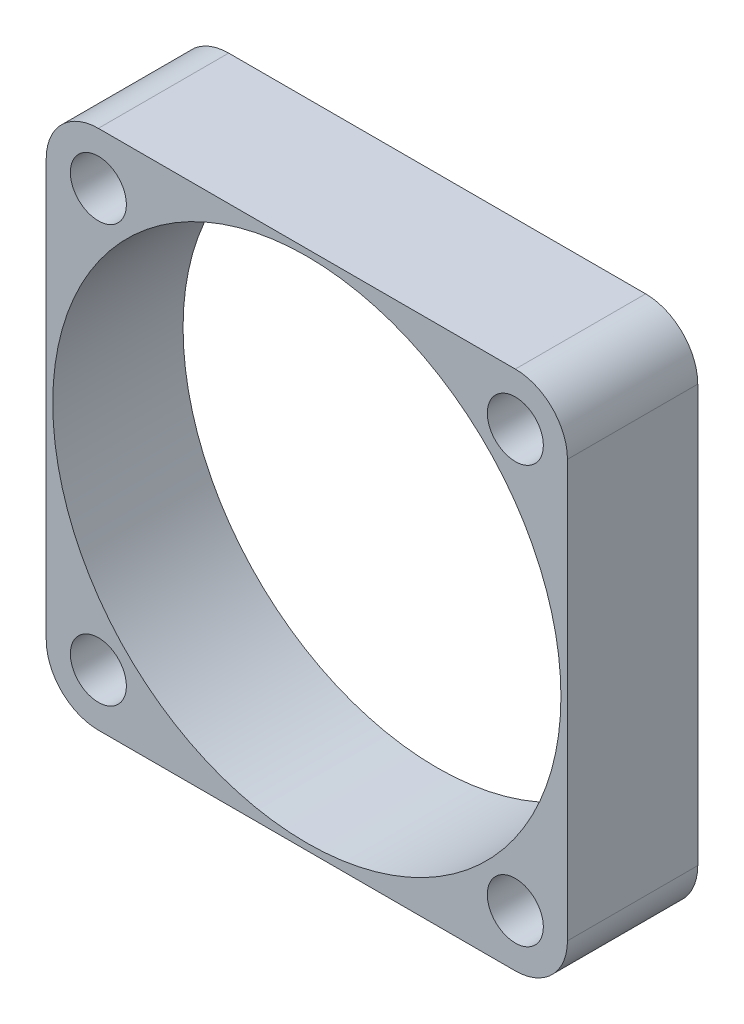
ISO-10303-21;
HEADER;
FILE_DESCRIPTION(('STEP AP214'),'2;1');
FILE_NAME('part.step','',(''),(''),'','','');
FILE_SCHEMA(('AUTOMOTIVE_DESIGN { 1 0 10303 214 1 1 1 1 }'));
ENDSEC;
DATA;
#1=APPLICATION_CONTEXT('core data for automotive mechanical design processes');
#2=APPLICATION_PROTOCOL_DEFINITION('international standard','automotive_design',2000,#1);
#3=PRODUCT_CONTEXT('',#1,'mechanical');
#4=PRODUCT('Part','Part','',(#3));
#5=PRODUCT_RELATED_PRODUCT_CATEGORY('part','',(#4));
#6=PRODUCT_DEFINITION_FORMATION('','',#4);
#7=PRODUCT_DEFINITION_CONTEXT('part definition',#1,'design');
#8=PRODUCT_DEFINITION('design','',#6,#7);
#9=PRODUCT_DEFINITION_SHAPE('','',#8);
#10=(LENGTH_UNIT() NAMED_UNIT(*) SI_UNIT(.MILLI.,.METRE.));
#11=(NAMED_UNIT(*) PLANE_ANGLE_UNIT() SI_UNIT($,.RADIAN.));
#12=(NAMED_UNIT(*) SI_UNIT($,.STERADIAN.) SOLID_ANGLE_UNIT());
#13=UNCERTAINTY_MEASURE_WITH_UNIT(LENGTH_MEASURE(1.E-05),#10,'distance_accuracy_value','');
#14=(GEOMETRIC_REPRESENTATION_CONTEXT(3) GLOBAL_UNCERTAINTY_ASSIGNED_CONTEXT((#13)) GLOBAL_UNIT_ASSIGNED_CONTEXT((#10,
#11,#12)) REPRESENTATION_CONTEXT('',''));
#15=CARTESIAN_POINT('',(0.,0.,0.));
#16=DIRECTION('',(0.,0.,1.));
#17=DIRECTION('',(1.,0.,0.));
#18=AXIS2_PLACEMENT_3D('',#15,#16,#17);
#19=CARTESIAN_POINT('',(36.,-4.,10.));
#20=DIRECTION('',(0.,0.,-1.));
#21=DIRECTION('',(-1.,0.,0.));
#22=AXIS2_PLACEMENT_3D('',#19,#20,#21);
#23=CYLINDRICAL_SURFACE('',#22,3.99999999999999);
#24=CARTESIAN_POINT('',(36.,-4.,0.));
#25=DIRECTION('',(0.,0.,1.));
#26=DIRECTION('',(-1.,0.,0.));
#27=AXIS2_PLACEMENT_3D('',#24,#25,#26);
#28=CIRCLE('',#27,3.99999999999999);
#29=CARTESIAN_POINT('',(40.,-4.,0.));
#30=VERTEX_POINT('',#29);
#31=CARTESIAN_POINT('',(36.,0.,0.));
#32=VERTEX_POINT('',#31);
#33=EDGE_CURVE('E99',#30,#32,#28,.T.);
#34=ORIENTED_EDGE('',*,*,#33,.T.);
#35=DIRECTION('',(0.,0.,-1.));
#36=VECTOR('',#35,1.);
#37=CARTESIAN_POINT('',(36.,0.,10.));
#38=LINE('',#37,#36);
#39=CARTESIAN_POINT('',(36.,0.,10.));
#40=VERTEX_POINT('',#39);
#41=EDGE_CURVE('E11',#40,#32,#38,.T.);
#42=ORIENTED_EDGE('',*,*,#41,.F.);
#43=CARTESIAN_POINT('',(36.,-4.,10.));
#44=DIRECTION('',(0.,0.,1.));
#45=DIRECTION('',(-1.,0.,0.));
#46=AXIS2_PLACEMENT_3D('',#43,#44,#45);
#47=CIRCLE('',#46,3.99999999999999);
#48=CARTESIAN_POINT('',(40.,-4.,10.));
#49=VERTEX_POINT('',#48);
#50=EDGE_CURVE('E132',#49,#40,#47,.T.);
#51=ORIENTED_EDGE('',*,*,#50,.F.);
#52=DIRECTION('',(0.,0.,-1.));
#53=VECTOR('',#52,1.);
#54=CARTESIAN_POINT('',(40.,-4.,10.));
#55=LINE('',#54,#53);
#56=EDGE_CURVE('E112',#49,#30,#55,.T.);
#57=ORIENTED_EDGE('',*,*,#56,.T.);
#58=EDGE_LOOP('',(#34,#42,#51,#57));
#59=FACE_BOUND('',#58,.T.);
#60=ADVANCED_FACE('F29',(#59),#23,.T.);
#61=CARTESIAN_POINT('',(4.00000000000003,0.,10.));
#62=DIRECTION('',(0.,-1.,0.));
#63=DIRECTION('',(0.,0.,-1.));
#64=AXIS2_PLACEMENT_3D('',#61,#62,#63);
#65=PLANE('',#64);
#66=DIRECTION('',(-1.,0.,0.));
#67=VECTOR('',#66,1.);
#68=CARTESIAN_POINT('',(4.00000000000003,0.,0.));
#69=LINE('',#68,#67);
#70=CARTESIAN_POINT('',(4.00000000000003,0.,0.));
#71=VERTEX_POINT('',#70);
#72=EDGE_CURVE('E95',#32,#71,#69,.T.);
#73=ORIENTED_EDGE('',*,*,#72,.T.);
#74=DIRECTION('',(0.,0.,-1.));
#75=VECTOR('',#74,1.);
#76=CARTESIAN_POINT('',(4.00000000000003,0.,10.));
#77=LINE('',#76,#75);
#78=CARTESIAN_POINT('',(4.00000000000003,0.,10.));
#79=VERTEX_POINT('',#78);
#80=EDGE_CURVE('E37',#79,#71,#77,.T.);
#81=ORIENTED_EDGE('',*,*,#80,.F.);
#82=DIRECTION('',(-1.,0.,0.));
#83=VECTOR('',#82,1.);
#84=CARTESIAN_POINT('',(4.00000000000003,0.,10.));
#85=LINE('',#84,#83);
#86=EDGE_CURVE('E108',#40,#79,#85,.T.);
#87=ORIENTED_EDGE('',*,*,#86,.F.);
#88=ORIENTED_EDGE('',*,*,#41,.T.);
#89=EDGE_LOOP('',(#73,#81,#87,#88));
#90=FACE_BOUND('',#89,.T.);
#91=ADVANCED_FACE('F107',(#90),#65,.F.);
#92=CARTESIAN_POINT('',(4.,-4.,10.));
#93=DIRECTION('',(0.,0.,-1.));
#94=DIRECTION('',(-1.,0.,0.));
#95=AXIS2_PLACEMENT_3D('',#92,#93,#94);
#96=CYLINDRICAL_SURFACE('',#95,4.);
#97=CARTESIAN_POINT('',(4.,-4.,0.));
#98=DIRECTION('',(0.,0.,1.));
#99=DIRECTION('',(-1.,0.,0.));
#100=AXIS2_PLACEMENT_3D('',#97,#98,#99);
#101=CIRCLE('',#100,4.);
#102=CARTESIAN_POINT('',(0.,-4.00000000000003,0.));
#103=VERTEX_POINT('',#102);
#104=EDGE_CURVE('E101',#71,#103,#101,.T.);
#105=ORIENTED_EDGE('',*,*,#104,.T.);
#106=DIRECTION('',(0.,0.,-1.));
#107=VECTOR('',#106,1.);
#108=CARTESIAN_POINT('',(0.,-4.00000000000003,10.));
#109=LINE('',#108,#107);
#110=CARTESIAN_POINT('',(0.,-4.00000000000003,10.));
#111=VERTEX_POINT('',#110);
#112=EDGE_CURVE('E158',#111,#103,#109,.T.);
#113=ORIENTED_EDGE('',*,*,#112,.F.);
#114=CARTESIAN_POINT('',(4.,-4.,10.));
#115=DIRECTION('',(0.,0.,1.));
#116=DIRECTION('',(-1.,0.,0.));
#117=AXIS2_PLACEMENT_3D('',#114,#115,#116);
#118=CIRCLE('',#117,4.);
#119=EDGE_CURVE('E135',#79,#111,#118,.T.);
#120=ORIENTED_EDGE('',*,*,#119,.F.);
#121=ORIENTED_EDGE('',*,*,#80,.T.);
#122=EDGE_LOOP('',(#105,#113,#120,#121));
#123=FACE_BOUND('',#122,.T.);
#124=ADVANCED_FACE('F199',(#123),#96,.T.);
#125=CARTESIAN_POINT('',(0.,-4.00000000000003,10.));
#126=DIRECTION('',(1.,0.,0.));
#127=DIRECTION('',(0.,1.,0.));
#128=AXIS2_PLACEMENT_3D('',#125,#126,#127);
#129=PLANE('',#128);
#130=DIRECTION('',(0.,-1.,0.));
#131=VECTOR('',#130,1.);
#132=CARTESIAN_POINT('',(0.,-4.00000000000003,0.));
#133=LINE('',#132,#131);
#134=CARTESIAN_POINT('',(0.,-36.,0.));
#135=VERTEX_POINT('',#134);
#136=EDGE_CURVE('E122',#103,#135,#133,.T.);
#137=ORIENTED_EDGE('',*,*,#136,.T.);
#138=DIRECTION('',(0.,0.,-1.));
#139=VECTOR('',#138,1.);
#140=CARTESIAN_POINT('',(0.,-36.,10.));
#141=LINE('',#140,#139);
#142=CARTESIAN_POINT('',(0.,-36.,10.));
#143=VERTEX_POINT('',#142);
#144=EDGE_CURVE('E155',#143,#135,#141,.T.);
#145=ORIENTED_EDGE('',*,*,#144,.F.);
#146=DIRECTION('',(0.,-1.,0.));
#147=VECTOR('',#146,1.);
#148=CARTESIAN_POINT('',(0.,-4.00000000000003,10.));
#149=LINE('',#148,#147);
#150=EDGE_CURVE('E137',#111,#143,#149,.T.);
#151=ORIENTED_EDGE('',*,*,#150,.F.);
#152=ORIENTED_EDGE('',*,*,#112,.T.);
#153=EDGE_LOOP('',(#137,#145,#151,#152));
#154=FACE_BOUND('',#153,.T.);
#155=ADVANCED_FACE('F203',(#154),#129,.F.);
#156=CARTESIAN_POINT('',(4.,-36.,10.));
#157=DIRECTION('',(0.,0.,-1.));
#158=DIRECTION('',(-1.,0.,0.));
#159=AXIS2_PLACEMENT_3D('',#156,#157,#158);
#160=CYLINDRICAL_SURFACE('',#159,4.);
#161=CARTESIAN_POINT('',(4.,-36.,0.));
#162=DIRECTION('',(0.,0.,1.));
#163=DIRECTION('',(-1.,0.,0.));
#164=AXIS2_PLACEMENT_3D('',#161,#162,#163);
#165=CIRCLE('',#164,4.);
#166=CARTESIAN_POINT('',(4.00000000000003,-40.,0.));
#167=VERTEX_POINT('',#166);
#168=EDGE_CURVE('E124',#135,#167,#165,.T.);
#169=ORIENTED_EDGE('',*,*,#168,.T.);
#170=DIRECTION('',(0.,0.,-1.));
#171=VECTOR('',#170,1.);
#172=CARTESIAN_POINT('',(4.00000000000003,-40.,10.));
#173=LINE('',#172,#171);
#174=CARTESIAN_POINT('',(4.00000000000003,-40.,10.));
#175=VERTEX_POINT('',#174);
#176=EDGE_CURVE('E152',#175,#167,#173,.T.);
#177=ORIENTED_EDGE('',*,*,#176,.F.);
#178=CARTESIAN_POINT('',(4.,-36.,10.));
#179=DIRECTION('',(0.,0.,1.));
#180=DIRECTION('',(-1.,0.,0.));
#181=AXIS2_PLACEMENT_3D('',#178,#179,#180);
#182=CIRCLE('',#181,4.);
#183=EDGE_CURVE('E139',#143,#175,#182,.T.);
#184=ORIENTED_EDGE('',*,*,#183,.F.);
#185=ORIENTED_EDGE('',*,*,#144,.T.);
#186=EDGE_LOOP('',(#169,#177,#184,#185));
#187=FACE_BOUND('',#186,.T.);
#188=ADVANCED_FACE('F209',(#187),#160,.T.);
#189=CARTESIAN_POINT('',(4.00000000000003,-40.,10.));
#190=DIRECTION('',(0.,1.,0.));
#191=DIRECTION('',(0.,0.,1.));
#192=AXIS2_PLACEMENT_3D('',#189,#190,#191);
#193=PLANE('',#192);
#194=DIRECTION('',(1.,0.,0.));
#195=VECTOR('',#194,1.);
#196=CARTESIAN_POINT('',(4.00000000000003,-40.,0.));
#197=LINE('',#196,#195);
#198=CARTESIAN_POINT('',(36.,-40.,0.));
#199=VERTEX_POINT('',#198);
#200=EDGE_CURVE('E126',#167,#199,#197,.T.);
#201=ORIENTED_EDGE('',*,*,#200,.T.);
#202=DIRECTION('',(0.,0.,-1.));
#203=VECTOR('',#202,1.);
#204=CARTESIAN_POINT('',(36.,-40.,10.));
#205=LINE('',#204,#203);
#206=CARTESIAN_POINT('',(36.,-40.,10.));
#207=VERTEX_POINT('',#206);
#208=EDGE_CURVE('E149',#207,#199,#205,.T.);
#209=ORIENTED_EDGE('',*,*,#208,.F.);
#210=DIRECTION('',(1.,0.,0.));
#211=VECTOR('',#210,1.);
#212=CARTESIAN_POINT('',(4.00000000000003,-40.,10.));
#213=LINE('',#212,#211);
#214=EDGE_CURVE('E141',#175,#207,#213,.T.);
#215=ORIENTED_EDGE('',*,*,#214,.F.);
#216=ORIENTED_EDGE('',*,*,#176,.T.);
#217=EDGE_LOOP('',(#201,#209,#215,#216));
#218=FACE_BOUND('',#217,.T.);
#219=ADVANCED_FACE('F213',(#218),#193,.F.);
#220=CARTESIAN_POINT('',(36.,-36.,10.));
#221=DIRECTION('',(0.,0.,-1.));
#222=DIRECTION('',(-1.,0.,0.));
#223=AXIS2_PLACEMENT_3D('',#220,#221,#222);
#224=CYLINDRICAL_SURFACE('',#223,4.);
#225=CARTESIAN_POINT('',(36.,-36.,0.));
#226=DIRECTION('',(0.,0.,1.));
#227=DIRECTION('',(1.,0.,0.));
#228=AXIS2_PLACEMENT_3D('',#225,#226,#227);
#229=CIRCLE('',#228,4.);
#230=CARTESIAN_POINT('',(40.,-36.,0.));
#231=VERTEX_POINT('',#230);
#232=EDGE_CURVE('E128',#199,#231,#229,.T.);
#233=ORIENTED_EDGE('',*,*,#232,.T.);
#234=DIRECTION('',(0.,0.,-1.));
#235=VECTOR('',#234,1.);
#236=CARTESIAN_POINT('',(40.,-36.,10.));
#237=LINE('',#236,#235);
#238=CARTESIAN_POINT('',(40.,-36.,10.));
#239=VERTEX_POINT('',#238);
#240=EDGE_CURVE('E146',#239,#231,#237,.T.);
#241=ORIENTED_EDGE('',*,*,#240,.F.);
#242=CARTESIAN_POINT('',(36.,-36.,10.));
#243=DIRECTION('',(0.,0.,1.));
#244=DIRECTION('',(1.,0.,0.));
#245=AXIS2_PLACEMENT_3D('',#242,#243,#244);
#246=CIRCLE('',#245,4.);
#247=EDGE_CURVE('E50',#207,#239,#246,.T.);
#248=ORIENTED_EDGE('',*,*,#247,.F.);
#249=ORIENTED_EDGE('',*,*,#208,.T.);
#250=EDGE_LOOP('',(#233,#241,#248,#249));
#251=FACE_BOUND('',#250,.T.);
#252=ADVANCED_FACE('F216',(#251),#224,.T.);
#253=CARTESIAN_POINT('',(40.,-4.,10.));
#254=DIRECTION('',(-1.,0.,0.));
#255=DIRECTION('',(0.,-1.,0.));
#256=AXIS2_PLACEMENT_3D('',#253,#254,#255);
#257=PLANE('',#256);
#258=DIRECTION('',(0.,1.,0.));
#259=VECTOR('',#258,1.);
#260=CARTESIAN_POINT('',(40.,-4.,0.));
#261=LINE('',#260,#259);
#262=EDGE_CURVE('E130',#231,#30,#261,.T.);
#263=ORIENTED_EDGE('',*,*,#262,.T.);
#264=ORIENTED_EDGE('',*,*,#56,.F.);
#265=DIRECTION('',(0.,1.,0.));
#266=VECTOR('',#265,1.);
#267=CARTESIAN_POINT('',(40.,-4.,10.));
#268=LINE('',#267,#266);
#269=EDGE_CURVE('E45',#239,#49,#268,.T.);
#270=ORIENTED_EDGE('',*,*,#269,.F.);
#271=ORIENTED_EDGE('',*,*,#240,.T.);
#272=EDGE_LOOP('',(#263,#264,#270,#271));
#273=FACE_BOUND('',#272,.T.);
#274=ADVANCED_FACE('F191',(#273),#257,.F.);
#275=CARTESIAN_POINT('',(36.,-4.,10.));
#276=DIRECTION('',(0.,0.,-1.));
#277=DIRECTION('',(-1.,0.,0.));
#278=AXIS2_PLACEMENT_3D('',#275,#276,#277);
#279=PLANE('',#278);
#280=CARTESIAN_POINT('',(36.,-36.,10.));
#281=DIRECTION('',(0.,0.,1.));
#282=DIRECTION('',(1.,0.,0.));
#283=AXIS2_PLACEMENT_3D('',#280,#281,#282);
#284=CIRCLE('',#283,2.15);
#285=CARTESIAN_POINT('',(38.15,-36.,10.));
#286=VERTEX_POINT('',#285);
#287=EDGE_CURVE('E181',#286,#286,#284,.T.);
#288=ORIENTED_EDGE('',*,*,#287,.F.);
#289=EDGE_LOOP('',(#288));
#290=FACE_BOUND('',#289,.T.);
#291=CARTESIAN_POINT('',(4.,-36.,10.));
#292=DIRECTION('',(0.,0.,1.));
#293=DIRECTION('',(1.,0.,0.));
#294=AXIS2_PLACEMENT_3D('',#291,#292,#293);
#295=CIRCLE('',#294,2.15);
#296=CARTESIAN_POINT('',(6.15,-36.,10.));
#297=VERTEX_POINT('',#296);
#298=EDGE_CURVE('E171',#297,#297,#295,.T.);
#299=ORIENTED_EDGE('',*,*,#298,.F.);
#300=EDGE_LOOP('',(#299));
#301=FACE_BOUND('',#300,.T.);
#302=CARTESIAN_POINT('',(4.,-4.,10.));
#303=DIRECTION('',(0.,0.,1.));
#304=DIRECTION('',(1.,0.,0.));
#305=AXIS2_PLACEMENT_3D('',#302,#303,#304);
#306=CIRCLE('',#305,2.15);
#307=CARTESIAN_POINT('',(6.15,-4.,10.));
#308=VERTEX_POINT('',#307);
#309=EDGE_CURVE('E168',#308,#308,#306,.T.);
#310=ORIENTED_EDGE('',*,*,#309,.F.);
#311=EDGE_LOOP('',(#310));
#312=FACE_BOUND('',#311,.T.);
#313=CARTESIAN_POINT('',(36.,-4.,10.));
#314=DIRECTION('',(0.,0.,1.));
#315=DIRECTION('',(1.,0.,0.));
#316=AXIS2_PLACEMENT_3D('',#313,#314,#315);
#317=CIRCLE('',#316,2.15);
#318=CARTESIAN_POINT('',(38.15,-4.,10.));
#319=VERTEX_POINT('',#318);
#320=EDGE_CURVE('E165',#319,#319,#317,.T.);
#321=ORIENTED_EDGE('',*,*,#320,.F.);
#322=EDGE_LOOP('',(#321));
#323=FACE_BOUND('',#322,.T.);
#324=CARTESIAN_POINT('',(20.,-20.,10.));
#325=DIRECTION('',(0.,0.,1.));
#326=DIRECTION('',(1.,0.,0.));
#327=AXIS2_PLACEMENT_3D('',#324,#325,#326);
#328=CIRCLE('',#327,19.5);
#329=CARTESIAN_POINT('',(39.5,-20.,10.));
#330=VERTEX_POINT('',#329);
#331=EDGE_CURVE('E116',#330,#330,#328,.T.);
#332=ORIENTED_EDGE('',*,*,#331,.F.);
#333=EDGE_LOOP('',(#332));
#334=FACE_BOUND('',#333,.T.);
#335=ORIENTED_EDGE('',*,*,#50,.T.);
#336=ORIENTED_EDGE('',*,*,#86,.T.);
#337=ORIENTED_EDGE('',*,*,#119,.T.);
#338=ORIENTED_EDGE('',*,*,#150,.T.);
#339=ORIENTED_EDGE('',*,*,#183,.T.);
#340=ORIENTED_EDGE('',*,*,#214,.T.);
#341=ORIENTED_EDGE('',*,*,#247,.T.);
#342=ORIENTED_EDGE('',*,*,#269,.T.);
#343=EDGE_LOOP('',(#335,#336,#337,#338,#339,#340,#341,#342));
#344=FACE_BOUND('',#343,.T.);
#345=ADVANCED_FACE('F188',(#290,#301,#312,#323,#334,#344),#279,.F.);
#346=CARTESIAN_POINT('',(36.,-4.,0.));
#347=DIRECTION('',(0.,0.,-1.));
#348=DIRECTION('',(-1.,0.,0.));
#349=AXIS2_PLACEMENT_3D('',#346,#347,#348);
#350=PLANE('',#349);
#351=CARTESIAN_POINT('',(36.,-36.,0.));
#352=DIRECTION('',(0.,0.,-1.));
#353=DIRECTION('',(-1.,0.,0.));
#354=AXIS2_PLACEMENT_3D('',#351,#352,#353);
#355=CIRCLE('',#354,2.15);
#356=CARTESIAN_POINT('',(33.85,-36.,0.));
#357=VERTEX_POINT('',#356);
#358=EDGE_CURVE('E32',#357,#357,#355,.T.);
#359=ORIENTED_EDGE('',*,*,#358,.F.);
#360=EDGE_LOOP('',(#359));
#361=FACE_BOUND('',#360,.T.);
#362=CARTESIAN_POINT('',(4.,-36.,0.));
#363=DIRECTION('',(0.,0.,-1.));
#364=DIRECTION('',(-1.,0.,0.));
#365=AXIS2_PLACEMENT_3D('',#362,#363,#364);
#366=CIRCLE('',#365,2.15);
#367=CARTESIAN_POINT('',(1.85,-36.,0.));
#368=VERTEX_POINT('',#367);
#369=EDGE_CURVE('E169',#368,#368,#366,.T.);
#370=ORIENTED_EDGE('',*,*,#369,.F.);
#371=EDGE_LOOP('',(#370));
#372=FACE_BOUND('',#371,.T.);
#373=CARTESIAN_POINT('',(4.,-4.,0.));
#374=DIRECTION('',(0.,0.,-1.));
#375=DIRECTION('',(-1.,0.,0.));
#376=AXIS2_PLACEMENT_3D('',#373,#374,#375);
#377=CIRCLE('',#376,2.15);
#378=CARTESIAN_POINT('',(1.85,-4.,0.));
#379=VERTEX_POINT('',#378);
#380=EDGE_CURVE('E166',#379,#379,#377,.T.);
#381=ORIENTED_EDGE('',*,*,#380,.F.);
#382=EDGE_LOOP('',(#381));
#383=FACE_BOUND('',#382,.T.);
#384=CARTESIAN_POINT('',(36.,-4.,0.));
#385=DIRECTION('',(0.,0.,-1.));
#386=DIRECTION('',(-1.,0.,0.));
#387=AXIS2_PLACEMENT_3D('',#384,#385,#386);
#388=CIRCLE('',#387,2.15);
#389=CARTESIAN_POINT('',(33.85,-4.,0.));
#390=VERTEX_POINT('',#389);
#391=EDGE_CURVE('E162',#390,#390,#388,.T.);
#392=ORIENTED_EDGE('',*,*,#391,.F.);
#393=EDGE_LOOP('',(#392));
#394=FACE_BOUND('',#393,.T.);
#395=CARTESIAN_POINT('',(20.,-20.,0.));
#396=DIRECTION('',(0.,0.,-1.));
#397=DIRECTION('',(-1.,0.,0.));
#398=AXIS2_PLACEMENT_3D('',#395,#396,#397);
#399=CIRCLE('',#398,19.5);
#400=CARTESIAN_POINT('',(0.500000000000007,-20.,0.));
#401=VERTEX_POINT('',#400);
#402=EDGE_CURVE('E113',#401,#401,#399,.T.);
#403=ORIENTED_EDGE('',*,*,#402,.F.);
#404=EDGE_LOOP('',(#403));
#405=FACE_BOUND('',#404,.T.);
#406=ORIENTED_EDGE('',*,*,#33,.F.);
#407=ORIENTED_EDGE('',*,*,#262,.F.);
#408=ORIENTED_EDGE('',*,*,#232,.F.);
#409=ORIENTED_EDGE('',*,*,#200,.F.);
#410=ORIENTED_EDGE('',*,*,#168,.F.);
#411=ORIENTED_EDGE('',*,*,#136,.F.);
#412=ORIENTED_EDGE('',*,*,#104,.F.);
#413=ORIENTED_EDGE('',*,*,#72,.F.);
#414=EDGE_LOOP('',(#406,#407,#408,#409,#410,#411,#412,#413));
#415=FACE_BOUND('',#414,.T.);
#416=ADVANCED_FACE('F96',(#361,#372,#383,#394,#405,#415),#350,.T.);
#417=CARTESIAN_POINT('',(20.,-20.,-10.));
#418=DIRECTION('',(0.,0.,1.));
#419=DIRECTION('',(1.,0.,0.));
#420=AXIS2_PLACEMENT_3D('',#417,#418,#419);
#421=CYLINDRICAL_SURFACE('',#420,19.5);
#422=ORIENTED_EDGE('',*,*,#402,.T.);
#423=EDGE_LOOP('',(#422));
#424=FACE_BOUND('',#423,.T.);
#425=ORIENTED_EDGE('',*,*,#331,.T.);
#426=EDGE_LOOP('',(#425));
#427=FACE_BOUND('',#426,.T.);
#428=ADVANCED_FACE('F256',(#424,#427),#421,.F.);
#429=CARTESIAN_POINT('',(36.,-4.,-10.));
#430=DIRECTION('',(0.,0.,1.));
#431=DIRECTION('',(1.,0.,0.));
#432=AXIS2_PLACEMENT_3D('',#429,#430,#431);
#433=CYLINDRICAL_SURFACE('',#432,2.15);
#434=ORIENTED_EDGE('',*,*,#391,.T.);
#435=EDGE_LOOP('',(#434));
#436=FACE_BOUND('',#435,.T.);
#437=ORIENTED_EDGE('',*,*,#320,.T.);
#438=EDGE_LOOP('',(#437));
#439=FACE_BOUND('',#438,.T.);
#440=ADVANCED_FACE('F186',(#436,#439),#433,.F.);
#441=CARTESIAN_POINT('',(4.,-4.,-10.));
#442=DIRECTION('',(0.,0.,1.));
#443=DIRECTION('',(1.,0.,0.));
#444=AXIS2_PLACEMENT_3D('',#441,#442,#443);
#445=CYLINDRICAL_SURFACE('',#444,2.15);
#446=ORIENTED_EDGE('',*,*,#380,.T.);
#447=EDGE_LOOP('',(#446));
#448=FACE_BOUND('',#447,.T.);
#449=ORIENTED_EDGE('',*,*,#309,.T.);
#450=EDGE_LOOP('',(#449));
#451=FACE_BOUND('',#450,.T.);
#452=ADVANCED_FACE('F284',(#448,#451),#445,.F.);
#453=CARTESIAN_POINT('',(4.,-36.,-10.));
#454=DIRECTION('',(0.,0.,1.));
#455=DIRECTION('',(1.,0.,0.));
#456=AXIS2_PLACEMENT_3D('',#453,#454,#455);
#457=CYLINDRICAL_SURFACE('',#456,2.15);
#458=ORIENTED_EDGE('',*,*,#369,.T.);
#459=EDGE_LOOP('',(#458));
#460=FACE_BOUND('',#459,.T.);
#461=ORIENTED_EDGE('',*,*,#298,.T.);
#462=EDGE_LOOP('',(#461));
#463=FACE_BOUND('',#462,.T.);
#464=ADVANCED_FACE('F294',(#460,#463),#457,.F.);
#465=CARTESIAN_POINT('',(36.,-36.,-10.));
#466=DIRECTION('',(0.,0.,1.));
#467=DIRECTION('',(1.,0.,0.));
#468=AXIS2_PLACEMENT_3D('',#465,#466,#467);
#469=CYLINDRICAL_SURFACE('',#468,2.15);
#470=ORIENTED_EDGE('',*,*,#358,.T.);
#471=EDGE_LOOP('',(#470));
#472=FACE_BOUND('',#471,.T.);
#473=ORIENTED_EDGE('',*,*,#287,.T.);
#474=EDGE_LOOP('',(#473));
#475=FACE_BOUND('',#474,.T.);
#476=ADVANCED_FACE('F304',(#472,#475),#469,.F.);
#477=CLOSED_SHELL('',(#60,#91,#124,#155,#188,#219,#252,#274,#345,#416,#428,#440,#452,#464,#476));
#478=MANIFOLD_SOLID_BREP('B2',#477);
#479=ADVANCED_BREP_SHAPE_REPRESENTATION('',(#18,#478),#14);
#480=SHAPE_DEFINITION_REPRESENTATION(#9,#479);
ENDSEC;
END-ISO-10303-21;
